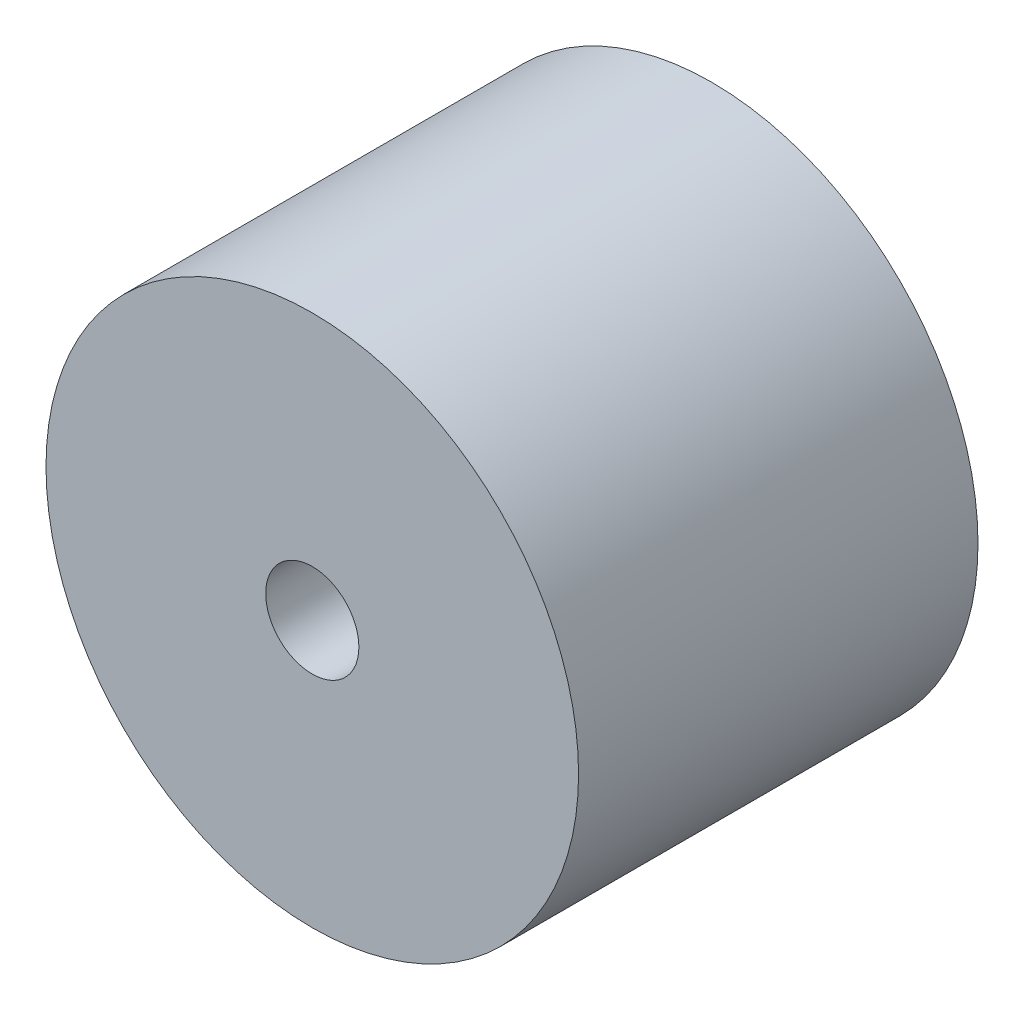
ISO-10303-21;
HEADER;
FILE_DESCRIPTION(('STEP AP214'),'2;1');
FILE_NAME('part.step','',(''),(''),'','','');
FILE_SCHEMA(('AUTOMOTIVE_DESIGN { 1 0 10303 214 1 1 1 1 }'));
ENDSEC;
DATA;
#1=APPLICATION_CONTEXT('core data for automotive mechanical design processes');
#2=APPLICATION_PROTOCOL_DEFINITION('international standard','automotive_design',2000,#1);
#3=PRODUCT_CONTEXT('',#1,'mechanical');
#4=PRODUCT('Part','Part','',(#3));
#5=PRODUCT_RELATED_PRODUCT_CATEGORY('part','',(#4));
#6=PRODUCT_DEFINITION_FORMATION('','',#4);
#7=PRODUCT_DEFINITION_CONTEXT('part definition',#1,'design');
#8=PRODUCT_DEFINITION('design','',#6,#7);
#9=PRODUCT_DEFINITION_SHAPE('','',#8);
#10=(LENGTH_UNIT() NAMED_UNIT(*) SI_UNIT(.MILLI.,.METRE.));
#11=(NAMED_UNIT(*) PLANE_ANGLE_UNIT() SI_UNIT($,.RADIAN.));
#12=(NAMED_UNIT(*) SI_UNIT($,.STERADIAN.) SOLID_ANGLE_UNIT());
#13=UNCERTAINTY_MEASURE_WITH_UNIT(LENGTH_MEASURE(1.E-05),#10,'distance_accuracy_value','');
#14=(GEOMETRIC_REPRESENTATION_CONTEXT(3) GLOBAL_UNCERTAINTY_ASSIGNED_CONTEXT((#13)) GLOBAL_UNIT_ASSIGNED_CONTEXT((#10,
#11,#12)) REPRESENTATION_CONTEXT('',''));
#15=CARTESIAN_POINT('',(0.,0.,0.));
#16=DIRECTION('',(0.,0.,1.));
#17=DIRECTION('',(1.,0.,0.));
#18=AXIS2_PLACEMENT_3D('',#15,#16,#17);
#19=CARTESIAN_POINT('',(0.,0.,15.));
#20=DIRECTION('',(0.,0.,1.));
#21=DIRECTION('',(1.,0.,0.));
#22=AXIS2_PLACEMENT_3D('',#19,#20,#21);
#23=PLANE('',#22);
#24=CARTESIAN_POINT('',(0.,0.,15.));
#25=DIRECTION('',(0.,0.,1.));
#26=DIRECTION('',(1.,0.,0.));
#27=AXIS2_PLACEMENT_3D('',#24,#25,#26);
#28=CIRCLE('',#27,10.);
#29=CARTESIAN_POINT('',(10.,0.,15.));
#30=VERTEX_POINT('',#29);
#31=EDGE_CURVE('E10',#30,#30,#28,.T.);
#32=ORIENTED_EDGE('',*,*,#31,.T.);
#33=EDGE_LOOP('',(#32));
#34=FACE_BOUND('',#33,.T.);
#35=CARTESIAN_POINT('',(0.,0.,15.));
#36=DIRECTION('',(0.,0.,1.));
#37=DIRECTION('',(1.,0.,0.));
#38=AXIS2_PLACEMENT_3D('',#35,#36,#37);
#39=CIRCLE('',#38,1.75);
#40=CARTESIAN_POINT('',(1.75,0.,15.));
#41=VERTEX_POINT('',#40);
#42=EDGE_CURVE('E46',#41,#41,#39,.T.);
#43=ORIENTED_EDGE('',*,*,#42,.F.);
#44=EDGE_LOOP('',(#43));
#45=FACE_BOUND('',#44,.T.);
#46=ADVANCED_FACE('F35',(#34,#45),#23,.T.);
#47=CARTESIAN_POINT('',(0.,0.,0.));
#48=DIRECTION('',(0.,0.,1.));
#49=DIRECTION('',(1.,0.,0.));
#50=AXIS2_PLACEMENT_3D('',#47,#48,#49);
#51=PLANE('',#50);
#52=CARTESIAN_POINT('',(0.,0.,0.));
#53=DIRECTION('',(0.,0.,1.));
#54=DIRECTION('',(1.,0.,0.));
#55=AXIS2_PLACEMENT_3D('',#52,#53,#54);
#56=CIRCLE('',#55,10.);
#57=CARTESIAN_POINT('',(10.,0.,0.));
#58=VERTEX_POINT('',#57);
#59=EDGE_CURVE('E39',#58,#58,#56,.T.);
#60=ORIENTED_EDGE('',*,*,#59,.F.);
#61=EDGE_LOOP('',(#60));
#62=FACE_BOUND('',#61,.T.);
#63=CARTESIAN_POINT('',(0.,0.,0.));
#64=DIRECTION('',(0.,0.,1.));
#65=DIRECTION('',(1.,0.,0.));
#66=AXIS2_PLACEMENT_3D('',#63,#64,#65);
#67=CIRCLE('',#66,1.75);
#68=CARTESIAN_POINT('',(1.75,0.,0.));
#69=VERTEX_POINT('',#68);
#70=EDGE_CURVE('E48',#69,#69,#67,.T.);
#71=ORIENTED_EDGE('',*,*,#70,.T.);
#72=EDGE_LOOP('',(#71));
#73=FACE_BOUND('',#72,.T.);
#74=ADVANCED_FACE('F58',(#62,#73),#51,.F.);
#75=CARTESIAN_POINT('',(0.,0.,15.));
#76=DIRECTION('',(0.,0.,-1.));
#77=DIRECTION('',(-1.,0.,0.));
#78=AXIS2_PLACEMENT_3D('',#75,#76,#77);
#79=CYLINDRICAL_SURFACE('',#78,10.);
#80=ORIENTED_EDGE('',*,*,#31,.F.);
#81=EDGE_LOOP('',(#80));
#82=FACE_BOUND('',#81,.T.);
#83=ORIENTED_EDGE('',*,*,#59,.T.);
#84=EDGE_LOOP('',(#83));
#85=FACE_BOUND('',#84,.T.);
#86=ADVANCED_FACE('F37',(#82,#85),#79,.T.);
#87=CARTESIAN_POINT('',(0.,0.,15.));
#88=DIRECTION('',(0.,0.,-1.));
#89=DIRECTION('',(-1.,0.,0.));
#90=AXIS2_PLACEMENT_3D('',#87,#88,#89);
#91=CYLINDRICAL_SURFACE('',#90,1.75);
#92=ORIENTED_EDGE('',*,*,#42,.T.);
#93=EDGE_LOOP('',(#92));
#94=FACE_BOUND('',#93,.T.);
#95=ORIENTED_EDGE('',*,*,#70,.F.);
#96=EDGE_LOOP('',(#95));
#97=FACE_BOUND('',#96,.T.);
#98=ADVANCED_FACE('F54',(#94,#97),#91,.F.);
#99=CLOSED_SHELL('',(#46,#74,#86,#98));
#100=MANIFOLD_SOLID_BREP('B2',#99);
#101=ADVANCED_BREP_SHAPE_REPRESENTATION('',(#18,#100),#14);
#102=SHAPE_DEFINITION_REPRESENTATION(#9,#101);
ENDSEC;
END-ISO-10303-21;
